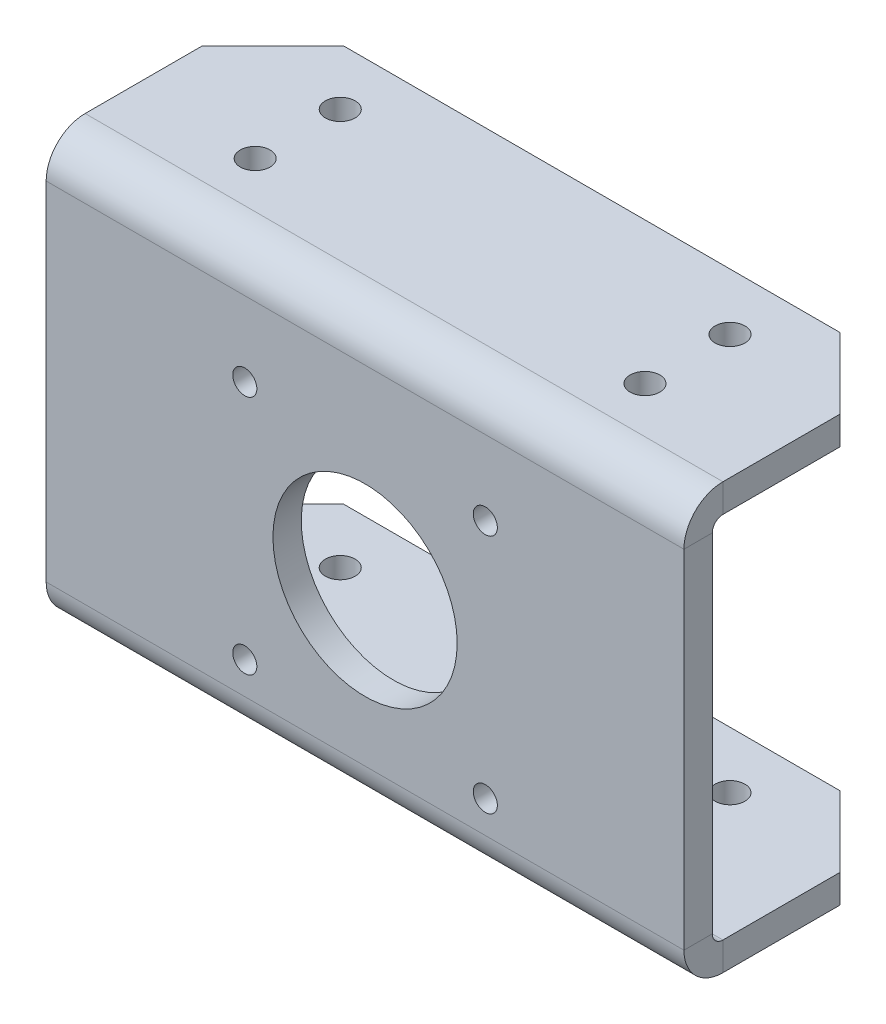
ISO-10303-21;
HEADER;
FILE_DESCRIPTION(('STEP AP214'),'2;1');
FILE_NAME('part.step','',(''),(''),'','','');
FILE_SCHEMA(('AUTOMOTIVE_DESIGN { 1 0 10303 214 1 1 1 1 }'));
ENDSEC;
DATA;
#1=APPLICATION_CONTEXT('core data for automotive mechanical design processes');
#2=APPLICATION_PROTOCOL_DEFINITION('international standard','automotive_design',2000,#1);
#3=PRODUCT_CONTEXT('',#1,'mechanical');
#4=PRODUCT('Part','Part','',(#3));
#5=PRODUCT_RELATED_PRODUCT_CATEGORY('part','',(#4));
#6=PRODUCT_DEFINITION_FORMATION('','',#4);
#7=PRODUCT_DEFINITION_CONTEXT('part definition',#1,'design');
#8=PRODUCT_DEFINITION('design','',#6,#7);
#9=PRODUCT_DEFINITION_SHAPE('','',#8);
#10=(LENGTH_UNIT() NAMED_UNIT(*) SI_UNIT(.MILLI.,.METRE.));
#11=(NAMED_UNIT(*) PLANE_ANGLE_UNIT() SI_UNIT($,.RADIAN.));
#12=(NAMED_UNIT(*) SI_UNIT($,.STERADIAN.) SOLID_ANGLE_UNIT());
#13=UNCERTAINTY_MEASURE_WITH_UNIT(LENGTH_MEASURE(1.E-05),#10,'distance_accuracy_value','');
#14=(GEOMETRIC_REPRESENTATION_CONTEXT(3) GLOBAL_UNCERTAINTY_ASSIGNED_CONTEXT((#13)) GLOBAL_UNIT_ASSIGNED_CONTEXT((#10,
#11,#12)) REPRESENTATION_CONTEXT('',''));
#15=CARTESIAN_POINT('',(0.,0.,0.));
#16=DIRECTION('',(0.,0.,1.));
#17=DIRECTION('',(1.,0.,0.));
#18=AXIS2_PLACEMENT_3D('',#15,#16,#17);
#19=CARTESIAN_POINT('',(45.,30.,0.));
#20=DIRECTION('',(0.,-1.,0.));
#21=DIRECTION('',(0.,0.,-1.));
#22=AXIS2_PLACEMENT_3D('',#19,#20,#21);
#23=PLANE('',#22);
#24=CARTESIAN_POINT('',(-27.5,30.,-24.));
#25=DIRECTION('',(0.,1.,0.));
#26=DIRECTION('',(0.,0.,1.));
#27=AXIS2_PLACEMENT_3D('',#24,#25,#26);
#28=CIRCLE('',#27,2.1);
#29=CARTESIAN_POINT('',(-27.5,30.,-21.9));
#30=VERTEX_POINT('',#29);
#31=EDGE_CURVE('E567',#30,#30,#28,.T.);
#32=ORIENTED_EDGE('',*,*,#31,.F.);
#33=EDGE_LOOP('',(#32));
#34=FACE_BOUND('',#33,.T.);
#35=CARTESIAN_POINT('',(-27.5,30.,-12.));
#36=DIRECTION('',(0.,1.,0.));
#37=DIRECTION('',(0.,0.,1.));
#38=AXIS2_PLACEMENT_3D('',#35,#36,#37);
#39=CIRCLE('',#38,2.1);
#40=CARTESIAN_POINT('',(-27.5,30.,-9.9));
#41=VERTEX_POINT('',#40);
#42=EDGE_CURVE('E319',#41,#41,#39,.T.);
#43=ORIENTED_EDGE('',*,*,#42,.F.);
#44=EDGE_LOOP('',(#43));
#45=FACE_BOUND('',#44,.T.);
#46=CARTESIAN_POINT('',(27.5,30.,-12.));
#47=DIRECTION('',(0.,1.,0.));
#48=DIRECTION('',(0.,0.,1.));
#49=AXIS2_PLACEMENT_3D('',#46,#47,#48);
#50=CIRCLE('',#49,2.1);
#51=CARTESIAN_POINT('',(27.5,30.,-9.9));
#52=VERTEX_POINT('',#51);
#53=EDGE_CURVE('E316',#52,#52,#50,.T.);
#54=ORIENTED_EDGE('',*,*,#53,.F.);
#55=EDGE_LOOP('',(#54));
#56=FACE_BOUND('',#55,.T.);
#57=DIRECTION('',(-1.,0.,0.));
#58=VECTOR('',#57,1.);
#59=CARTESIAN_POINT('',(45.,30.,-32.));
#60=LINE('',#59,#58);
#61=CARTESIAN_POINT('',(35.,30.,-32.));
#62=VERTEX_POINT('',#61);
#63=CARTESIAN_POINT('',(-34.9999999999999,30.,-32.));
#64=VERTEX_POINT('',#63);
#65=EDGE_CURVE('E248',#62,#64,#60,.T.);
#66=ORIENTED_EDGE('',*,*,#65,.T.);
#67=DIRECTION('',(-0.707106781186549,0.,0.707106781186546));
#68=VECTOR('',#67,1.);
#69=CARTESIAN_POINT('',(-45.,30.,-22.));
#70=LINE('',#69,#68);
#71=CARTESIAN_POINT('',(-45.,30.,-22.));
#72=VERTEX_POINT('',#71);
#73=EDGE_CURVE('E292',#64,#72,#70,.T.);
#74=ORIENTED_EDGE('',*,*,#73,.T.);
#75=DIRECTION('',(0.,0.,1.));
#76=VECTOR('',#75,1.);
#77=CARTESIAN_POINT('',(-45.,30.,0.));
#78=LINE('',#77,#76);
#79=CARTESIAN_POINT('',(-45.,30.,-5.49999999999999));
#80=VERTEX_POINT('',#79);
#81=EDGE_CURVE('E226',#72,#80,#78,.T.);
#82=ORIENTED_EDGE('',*,*,#81,.T.);
#83=DIRECTION('',(-1.,0.,0.));
#84=VECTOR('',#83,1.);
#85=CARTESIAN_POINT('',(45.,30.,-5.49999999999999));
#86=LINE('',#85,#84);
#87=CARTESIAN_POINT('',(45.,30.,-5.49999999999999));
#88=VERTEX_POINT('',#87);
#89=EDGE_CURVE('E245',#88,#80,#86,.T.);
#90=ORIENTED_EDGE('',*,*,#89,.F.);
#91=DIRECTION('',(0.,0.,1.));
#92=VECTOR('',#91,1.);
#93=CARTESIAN_POINT('',(45.,30.,0.));
#94=LINE('',#93,#92);
#95=CARTESIAN_POINT('',(45.,30.,-21.9999999999999));
#96=VERTEX_POINT('',#95);
#97=EDGE_CURVE('E201',#96,#88,#94,.T.);
#98=ORIENTED_EDGE('',*,*,#97,.F.);
#99=DIRECTION('',(0.707106781186547,0.,0.707106781186548));
#100=VECTOR('',#99,1.);
#101=CARTESIAN_POINT('',(35.,30.,-32.));
#102=LINE('',#101,#100);
#103=EDGE_CURVE('E290',#96,#62,#102,.F.);
#104=ORIENTED_EDGE('',*,*,#103,.T.);
#105=EDGE_LOOP('',(#66,#74,#82,#90,#98,#104));
#106=FACE_BOUND('',#105,.T.);
#107=CARTESIAN_POINT('',(27.5,30.,-24.));
#108=DIRECTION('',(0.,1.,0.));
#109=DIRECTION('',(0.,0.,1.));
#110=AXIS2_PLACEMENT_3D('',#107,#108,#109);
#111=CIRCLE('',#110,2.1);
#112=CARTESIAN_POINT('',(27.5,30.,-21.9));
#113=VERTEX_POINT('',#112);
#114=EDGE_CURVE('E339',#113,#113,#111,.T.);
#115=ORIENTED_EDGE('',*,*,#114,.F.);
#116=EDGE_LOOP('',(#115));
#117=FACE_BOUND('',#116,.T.);
#118=ADVANCED_FACE('F41',(#34,#45,#56,#106,#117),#23,.F.);
#119=CARTESIAN_POINT('',(45.,30.,-5.49999999999999));
#120=DIRECTION('',(1.,0.,0.));
#121=DIRECTION('',(0.,0.,-1.));
#122=AXIS2_PLACEMENT_3D('',#119,#120,#121);
#123=PLANE('',#122);
#124=DIRECTION('',(0.,-1.,0.));
#125=VECTOR('',#124,1.);
#126=CARTESIAN_POINT('',(45.,30.,-5.49999999999999));
#127=LINE('',#126,#125);
#128=CARTESIAN_POINT('',(45.,26.,-5.49999999999999));
#129=VERTEX_POINT('',#128);
#130=EDGE_CURVE('E275',#88,#129,#127,.T.);
#131=ORIENTED_EDGE('',*,*,#130,.F.);
#132=CARTESIAN_POINT('',(45.,24.5,-5.49999999999999));
#133=DIRECTION('',(-1.,0.,0.));
#134=DIRECTION('',(0.,0.,1.));
#135=AXIS2_PLACEMENT_3D('',#132,#133,#134);
#136=CIRCLE('',#135,5.5);
#137=CARTESIAN_POINT('',(45.,24.5,0.));
#138=VERTEX_POINT('',#137);
#139=EDGE_CURVE('E203',#88,#138,#136,.F.);
#140=ORIENTED_EDGE('',*,*,#139,.T.);
#141=DIRECTION('',(0.,0.,1.));
#142=VECTOR('',#141,1.);
#143=CARTESIAN_POINT('',(45.,24.5,-3.99999999999999));
#144=LINE('',#143,#142);
#145=CARTESIAN_POINT('',(45.,24.5,-3.99999999999999));
#146=VERTEX_POINT('',#145);
#147=EDGE_CURVE('E273',#146,#138,#144,.T.);
#148=ORIENTED_EDGE('',*,*,#147,.F.);
#149=CARTESIAN_POINT('',(45.,24.5,-5.49999999999999));
#150=DIRECTION('',(1.,0.,0.));
#151=DIRECTION('',(0.,0.,-1.));
#152=AXIS2_PLACEMENT_3D('',#149,#150,#151);
#153=CIRCLE('',#152,1.5);
#154=EDGE_CURVE('E193',#129,#146,#153,.T.);
#155=ORIENTED_EDGE('',*,*,#154,.F.);
#156=EDGE_LOOP('',(#131,#140,#148,#155));
#157=FACE_BOUND('',#156,.T.);
#158=ADVANCED_FACE('F397',(#157),#123,.T.);
#159=CARTESIAN_POINT('',(45.,24.5,-3.99999999999999));
#160=DIRECTION('',(1.,0.,0.));
#161=DIRECTION('',(0.,0.,-1.));
#162=AXIS2_PLACEMENT_3D('',#159,#160,#161);
#163=PLANE('',#162);
#164=DIRECTION('',(0.,0.,1.));
#165=VECTOR('',#164,1.);
#166=CARTESIAN_POINT('',(45.,26.,0.));
#167=LINE('',#166,#165);
#168=CARTESIAN_POINT('',(45.,26.,-22.));
#169=VERTEX_POINT('',#168);
#170=EDGE_CURVE('E199',#169,#129,#167,.T.);
#171=ORIENTED_EDGE('',*,*,#170,.F.);
#172=DIRECTION('',(0.,1.,0.));
#173=VECTOR('',#172,1.);
#174=CARTESIAN_POINT('',(45.,24.5,-22.));
#175=LINE('',#174,#173);
#176=EDGE_CURVE('E11',#169,#96,#175,.T.);
#177=ORIENTED_EDGE('',*,*,#176,.T.);
#178=ORIENTED_EDGE('',*,*,#97,.T.);
#179=ORIENTED_EDGE('',*,*,#130,.T.);
#180=EDGE_LOOP('',(#171,#177,#178,#179));
#181=FACE_BOUND('',#180,.T.);
#182=ADVANCED_FACE('F415',(#181),#163,.T.);
#183=CARTESIAN_POINT('',(-45.,24.5,0.));
#184=DIRECTION('',(-1.,0.,0.));
#185=DIRECTION('',(0.,0.,1.));
#186=AXIS2_PLACEMENT_3D('',#183,#184,#185);
#187=PLANE('',#186);
#188=DIRECTION('',(0.,0.,-1.));
#189=VECTOR('',#188,1.);
#190=CARTESIAN_POINT('',(-45.,24.5,0.));
#191=LINE('',#190,#189);
#192=CARTESIAN_POINT('',(-45.,24.5,0.));
#193=VERTEX_POINT('',#192);
#194=CARTESIAN_POINT('',(-45.,24.5,-3.99999999999999));
#195=VERTEX_POINT('',#194);
#196=EDGE_CURVE('E271',#193,#195,#191,.T.);
#197=ORIENTED_EDGE('',*,*,#196,.F.);
#198=CARTESIAN_POINT('',(-45.,24.5,-5.49999999999999));
#199=DIRECTION('',(-1.,0.,0.));
#200=DIRECTION('',(0.,0.,1.));
#201=AXIS2_PLACEMENT_3D('',#198,#199,#200);
#202=CIRCLE('',#201,5.5);
#203=EDGE_CURVE('E228',#80,#193,#202,.F.);
#204=ORIENTED_EDGE('',*,*,#203,.F.);
#205=DIRECTION('',(0.,1.,0.));
#206=VECTOR('',#205,1.);
#207=CARTESIAN_POINT('',(-45.,26.,-5.49999999999999));
#208=LINE('',#207,#206);
#209=CARTESIAN_POINT('',(-45.,26.,-5.49999999999999));
#210=VERTEX_POINT('',#209);
#211=EDGE_CURVE('E268',#210,#80,#208,.T.);
#212=ORIENTED_EDGE('',*,*,#211,.F.);
#213=CARTESIAN_POINT('',(-45.,24.5,-5.49999999999999));
#214=DIRECTION('',(1.,0.,0.));
#215=DIRECTION('',(0.,0.,-1.));
#216=AXIS2_PLACEMENT_3D('',#213,#214,#215);
#217=CIRCLE('',#216,1.5);
#218=EDGE_CURVE('E221',#210,#195,#217,.T.);
#219=ORIENTED_EDGE('',*,*,#218,.T.);
#220=EDGE_LOOP('',(#197,#204,#212,#219));
#221=FACE_BOUND('',#220,.T.);
#222=ADVANCED_FACE('F405',(#221),#187,.T.);
#223=CARTESIAN_POINT('',(-45.,26.,-5.49999999999999));
#224=DIRECTION('',(-1.,0.,0.));
#225=DIRECTION('',(0.,0.,1.));
#226=AXIS2_PLACEMENT_3D('',#223,#224,#225);
#227=PLANE('',#226);
#228=DIRECTION('',(0.,-1.,0.));
#229=VECTOR('',#228,1.);
#230=CARTESIAN_POINT('',(-45.,-30.,0.));
#231=LINE('',#230,#229);
#232=CARTESIAN_POINT('',(-45.,-24.5,0.));
#233=VERTEX_POINT('',#232);
#234=EDGE_CURVE('E231',#193,#233,#231,.T.);
#235=ORIENTED_EDGE('',*,*,#234,.F.);
#236=ORIENTED_EDGE('',*,*,#196,.T.);
#237=DIRECTION('',(0.,-1.,0.));
#238=VECTOR('',#237,1.);
#239=CARTESIAN_POINT('',(-45.,-30.,-4.));
#240=LINE('',#239,#238);
#241=CARTESIAN_POINT('',(-45.,-24.5,-4.));
#242=VERTEX_POINT('',#241);
#243=EDGE_CURVE('E218',#195,#242,#240,.T.);
#244=ORIENTED_EDGE('',*,*,#243,.T.);
#245=DIRECTION('',(0.,0.,1.));
#246=VECTOR('',#245,1.);
#247=CARTESIAN_POINT('',(-45.,-24.5,-4.));
#248=LINE('',#247,#246);
#249=EDGE_CURVE('E264',#242,#233,#248,.T.);
#250=ORIENTED_EDGE('',*,*,#249,.T.);
#251=EDGE_LOOP('',(#235,#236,#244,#250));
#252=FACE_BOUND('',#251,.T.);
#253=ADVANCED_FACE('F382',(#252),#227,.T.);
#254=CARTESIAN_POINT('',(45.,-24.5,0.));
#255=DIRECTION('',(1.,0.,0.));
#256=DIRECTION('',(0.,0.,-1.));
#257=AXIS2_PLACEMENT_3D('',#254,#255,#256);
#258=PLANE('',#257);
#259=DIRECTION('',(0.,0.,-1.));
#260=VECTOR('',#259,1.);
#261=CARTESIAN_POINT('',(45.,-24.5,0.));
#262=LINE('',#261,#260);
#263=CARTESIAN_POINT('',(45.,-24.5,0.));
#264=VERTEX_POINT('',#263);
#265=CARTESIAN_POINT('',(45.,-24.5,-4.));
#266=VERTEX_POINT('',#265);
#267=EDGE_CURVE('E167',#264,#266,#262,.T.);
#268=ORIENTED_EDGE('',*,*,#267,.F.);
#269=CARTESIAN_POINT('',(45.,-24.5,-5.5));
#270=DIRECTION('',(-1.,0.,0.));
#271=DIRECTION('',(0.,0.,1.));
#272=AXIS2_PLACEMENT_3D('',#269,#270,#271);
#273=CIRCLE('',#272,5.5);
#274=CARTESIAN_POINT('',(45.,-30.,-5.5));
#275=VERTEX_POINT('',#274);
#276=EDGE_CURVE('E165',#264,#275,#273,.F.);
#277=ORIENTED_EDGE('',*,*,#276,.T.);
#278=DIRECTION('',(0.,-1.,0.));
#279=VECTOR('',#278,1.);
#280=CARTESIAN_POINT('',(45.,-26.,-5.5));
#281=LINE('',#280,#279);
#282=CARTESIAN_POINT('',(45.,-26.,-5.5));
#283=VERTEX_POINT('',#282);
#284=EDGE_CURVE('E158',#283,#275,#281,.T.);
#285=ORIENTED_EDGE('',*,*,#284,.F.);
#286=CARTESIAN_POINT('',(45.,-24.5,-5.5));
#287=DIRECTION('',(1.,0.,0.));
#288=DIRECTION('',(0.,0.,-1.));
#289=AXIS2_PLACEMENT_3D('',#286,#287,#288);
#290=CIRCLE('',#289,1.5);
#291=EDGE_CURVE('E162',#266,#283,#290,.T.);
#292=ORIENTED_EDGE('',*,*,#291,.F.);
#293=EDGE_LOOP('',(#268,#277,#285,#292));
#294=FACE_BOUND('',#293,.T.);
#295=ADVANCED_FACE('F160',(#294),#258,.T.);
#296=CARTESIAN_POINT('',(45.,-26.,-5.5));
#297=DIRECTION('',(1.,0.,0.));
#298=DIRECTION('',(0.,0.,-1.));
#299=AXIS2_PLACEMENT_3D('',#296,#297,#298);
#300=PLANE('',#299);
#301=DIRECTION('',(0.,-1.,0.));
#302=VECTOR('',#301,1.);
#303=CARTESIAN_POINT('',(45.,-30.,0.));
#304=LINE('',#303,#302);
#305=EDGE_CURVE('E206',#138,#264,#304,.T.);
#306=ORIENTED_EDGE('',*,*,#305,.T.);
#307=ORIENTED_EDGE('',*,*,#267,.T.);
#308=DIRECTION('',(0.,-1.,0.));
#309=VECTOR('',#308,1.);
#310=CARTESIAN_POINT('',(45.,-30.,-4.));
#311=LINE('',#310,#309);
#312=EDGE_CURVE('E191',#146,#266,#311,.T.);
#313=ORIENTED_EDGE('',*,*,#312,.F.);
#314=ORIENTED_EDGE('',*,*,#147,.T.);
#315=EDGE_LOOP('',(#306,#307,#313,#314));
#316=FACE_BOUND('',#315,.T.);
#317=ADVANCED_FACE('F389',(#316),#300,.T.);
#318=CARTESIAN_POINT('',(-45.,-30.,-5.5));
#319=DIRECTION('',(-1.,0.,0.));
#320=DIRECTION('',(0.,0.,1.));
#321=AXIS2_PLACEMENT_3D('',#318,#319,#320);
#322=PLANE('',#321);
#323=DIRECTION('',(0.,1.,0.));
#324=VECTOR('',#323,1.);
#325=CARTESIAN_POINT('',(-45.,-30.,-5.5));
#326=LINE('',#325,#324);
#327=CARTESIAN_POINT('',(-45.,-30.,-5.5));
#328=VERTEX_POINT('',#327);
#329=CARTESIAN_POINT('',(-45.,-26.,-5.5));
#330=VERTEX_POINT('',#329);
#331=EDGE_CURVE('E168',#328,#330,#326,.T.);
#332=ORIENTED_EDGE('',*,*,#331,.F.);
#333=CARTESIAN_POINT('',(-45.,-24.5,-5.5));
#334=DIRECTION('',(-1.,0.,0.));
#335=DIRECTION('',(0.,0.,1.));
#336=AXIS2_PLACEMENT_3D('',#333,#334,#335);
#337=CIRCLE('',#336,5.5);
#338=EDGE_CURVE('E234',#233,#328,#337,.F.);
#339=ORIENTED_EDGE('',*,*,#338,.F.);
#340=ORIENTED_EDGE('',*,*,#249,.F.);
#341=CARTESIAN_POINT('',(-45.,-24.5,-5.5));
#342=DIRECTION('',(1.,0.,0.));
#343=DIRECTION('',(0.,0.,-1.));
#344=AXIS2_PLACEMENT_3D('',#341,#342,#343);
#345=CIRCLE('',#344,1.5);
#346=EDGE_CURVE('E216',#242,#330,#345,.T.);
#347=ORIENTED_EDGE('',*,*,#346,.T.);
#348=EDGE_LOOP('',(#332,#339,#340,#347));
#349=FACE_BOUND('',#348,.T.);
#350=ADVANCED_FACE('F372',(#349),#322,.T.);
#351=CARTESIAN_POINT('',(-45.,-24.5,-4.));
#352=DIRECTION('',(-1.,0.,0.));
#353=DIRECTION('',(0.,0.,1.));
#354=AXIS2_PLACEMENT_3D('',#351,#352,#353);
#355=PLANE('',#354);
#356=DIRECTION('',(0.,0.,-1.));
#357=VECTOR('',#356,1.);
#358=CARTESIAN_POINT('',(-45.,-26.,0.));
#359=LINE('',#358,#357);
#360=CARTESIAN_POINT('',(-45.,-26.,-22.));
#361=VERTEX_POINT('',#360);
#362=EDGE_CURVE('E178',#330,#361,#359,.T.);
#363=ORIENTED_EDGE('',*,*,#362,.T.);
#364=DIRECTION('',(0.,-1.,0.));
#365=VECTOR('',#364,1.);
#366=CARTESIAN_POINT('',(-45.,-24.5,-22.));
#367=LINE('',#366,#365);
#368=CARTESIAN_POINT('',(-45.,-30.,-22.));
#369=VERTEX_POINT('',#368);
#370=EDGE_CURVE('E294',#361,#369,#367,.T.);
#371=ORIENTED_EDGE('',*,*,#370,.T.);
#372=DIRECTION('',(0.,0.,-1.));
#373=VECTOR('',#372,1.);
#374=CARTESIAN_POINT('',(-45.,-30.,0.));
#375=LINE('',#374,#373);
#376=EDGE_CURVE('E211',#328,#369,#375,.T.);
#377=ORIENTED_EDGE('',*,*,#376,.F.);
#378=ORIENTED_EDGE('',*,*,#331,.T.);
#379=EDGE_LOOP('',(#363,#371,#377,#378));
#380=FACE_BOUND('',#379,.T.);
#381=ADVANCED_FACE('F369',(#380),#355,.T.);
#382=CARTESIAN_POINT('',(45.,-30.,0.));
#383=DIRECTION('',(0.,1.,0.));
#384=DIRECTION('',(0.,0.,1.));
#385=AXIS2_PLACEMENT_3D('',#382,#383,#384);
#386=PLANE('',#385);
#387=CARTESIAN_POINT('',(-27.5,-30.,-24.));
#388=DIRECTION('',(0.,1.,0.));
#389=DIRECTION('',(0.,0.,1.));
#390=AXIS2_PLACEMENT_3D('',#387,#388,#389);
#391=CIRCLE('',#390,2.09999999999999);
#392=CARTESIAN_POINT('',(-27.5,-30.,-21.9));
#393=VERTEX_POINT('',#392);
#394=EDGE_CURVE('E571',#393,#393,#391,.T.);
#395=ORIENTED_EDGE('',*,*,#394,.T.);
#396=EDGE_LOOP('',(#395));
#397=FACE_BOUND('',#396,.T.);
#398=CARTESIAN_POINT('',(-27.5,-30.,-12.));
#399=DIRECTION('',(0.,1.,0.));
#400=DIRECTION('',(0.,0.,1.));
#401=AXIS2_PLACEMENT_3D('',#398,#399,#400);
#402=CIRCLE('',#401,2.09999999999999);
#403=CARTESIAN_POINT('',(-27.5,-30.,-9.90000000000003));
#404=VERTEX_POINT('',#403);
#405=EDGE_CURVE('E312',#404,#404,#402,.T.);
#406=ORIENTED_EDGE('',*,*,#405,.T.);
#407=EDGE_LOOP('',(#406));
#408=FACE_BOUND('',#407,.T.);
#409=CARTESIAN_POINT('',(27.5,-30.,-12.));
#410=DIRECTION('',(0.,1.,0.));
#411=DIRECTION('',(0.,0.,1.));
#412=AXIS2_PLACEMENT_3D('',#409,#410,#411);
#413=CIRCLE('',#412,2.09999999999999);
#414=CARTESIAN_POINT('',(27.5,-30.,-9.90000000000004));
#415=VERTEX_POINT('',#414);
#416=EDGE_CURVE('E330',#415,#415,#413,.T.);
#417=ORIENTED_EDGE('',*,*,#416,.T.);
#418=EDGE_LOOP('',(#417));
#419=FACE_BOUND('',#418,.T.);
#420=CARTESIAN_POINT('',(27.5,-30.,-24.));
#421=DIRECTION('',(0.,1.,0.));
#422=DIRECTION('',(0.,0.,1.));
#423=AXIS2_PLACEMENT_3D('',#420,#421,#422);
#424=CIRCLE('',#423,2.09999999999999);
#425=CARTESIAN_POINT('',(27.5,-30.,-21.9));
#426=VERTEX_POINT('',#425);
#427=EDGE_CURVE('E342',#426,#426,#424,.T.);
#428=ORIENTED_EDGE('',*,*,#427,.T.);
#429=EDGE_LOOP('',(#428));
#430=FACE_BOUND('',#429,.T.);
#431=ORIENTED_EDGE('',*,*,#376,.T.);
#432=DIRECTION('',(-0.707106781186549,0.,0.707106781186546));
#433=VECTOR('',#432,1.);
#434=CARTESIAN_POINT('',(-45.,-30.,-22.));
#435=LINE('',#434,#433);
#436=CARTESIAN_POINT('',(-34.9999999999999,-30.,-32.));
#437=VERTEX_POINT('',#436);
#438=EDGE_CURVE('E299',#369,#437,#435,.F.);
#439=ORIENTED_EDGE('',*,*,#438,.T.);
#440=DIRECTION('',(-1.,0.,0.));
#441=VECTOR('',#440,1.);
#442=CARTESIAN_POINT('',(45.,-30.,-32.));
#443=LINE('',#442,#441);
#444=CARTESIAN_POINT('',(35.,-30.,-32.));
#445=VERTEX_POINT('',#444);
#446=EDGE_CURVE('E262',#445,#437,#443,.T.);
#447=ORIENTED_EDGE('',*,*,#446,.F.);
#448=DIRECTION('',(-0.707106781186547,0.,-0.707106781186548));
#449=VECTOR('',#448,1.);
#450=CARTESIAN_POINT('',(35.,-30.,-32.));
#451=LINE('',#450,#449);
#452=CARTESIAN_POINT('',(45.,-30.,-22.));
#453=VERTEX_POINT('',#452);
#454=EDGE_CURVE('E297',#445,#453,#451,.F.);
#455=ORIENTED_EDGE('',*,*,#454,.T.);
#456=DIRECTION('',(0.,0.,-1.));
#457=VECTOR('',#456,1.);
#458=CARTESIAN_POINT('',(45.,-30.,0.));
#459=LINE('',#458,#457);
#460=EDGE_CURVE('E186',#275,#453,#459,.T.);
#461=ORIENTED_EDGE('',*,*,#460,.F.);
#462=DIRECTION('',(-1.,0.,0.));
#463=VECTOR('',#462,1.);
#464=CARTESIAN_POINT('',(45.,-30.,-5.5));
#465=LINE('',#464,#463);
#466=EDGE_CURVE('E210',#275,#328,#465,.T.);
#467=ORIENTED_EDGE('',*,*,#466,.T.);
#468=EDGE_LOOP('',(#431,#439,#447,#455,#461,#467));
#469=FACE_BOUND('',#468,.T.);
#470=ADVANCED_FACE('F363',(#397,#408,#419,#430,#469),#386,.F.);
#471=CARTESIAN_POINT('',(45.,-26.,-32.));
#472=DIRECTION('',(0.,0.,-1.));
#473=DIRECTION('',(-1.,0.,0.));
#474=AXIS2_PLACEMENT_3D('',#471,#472,#473);
#475=PLANE('',#474);
#476=ORIENTED_EDGE('',*,*,#446,.T.);
#477=DIRECTION('',(0.,1.,0.));
#478=VECTOR('',#477,1.);
#479=CARTESIAN_POINT('',(-35.,-26.,-32.));
#480=LINE('',#479,#478);
#481=CARTESIAN_POINT('',(-34.9999999999999,-26.,-32.));
#482=VERTEX_POINT('',#481);
#483=EDGE_CURVE('E65',#437,#482,#480,.T.);
#484=ORIENTED_EDGE('',*,*,#483,.T.);
#485=DIRECTION('',(-1.,0.,0.));
#486=VECTOR('',#485,1.);
#487=CARTESIAN_POINT('',(45.,-26.,-32.));
#488=LINE('',#487,#486);
#489=CARTESIAN_POINT('',(35.,-26.,-32.));
#490=VERTEX_POINT('',#489);
#491=EDGE_CURVE('E182',#490,#482,#488,.T.);
#492=ORIENTED_EDGE('',*,*,#491,.F.);
#493=DIRECTION('',(0.,-1.,0.));
#494=VECTOR('',#493,1.);
#495=CARTESIAN_POINT('',(35.,-26.,-32.));
#496=LINE('',#495,#494);
#497=EDGE_CURVE('E301',#490,#445,#496,.T.);
#498=ORIENTED_EDGE('',*,*,#497,.T.);
#499=EDGE_LOOP('',(#476,#484,#492,#498));
#500=FACE_BOUND('',#499,.T.);
#501=ADVANCED_FACE('F361',(#500),#475,.T.);
#502=CARTESIAN_POINT('',(45.,-26.,0.));
#503=DIRECTION('',(0.,1.,0.));
#504=DIRECTION('',(0.,0.,1.));
#505=AXIS2_PLACEMENT_3D('',#502,#503,#504);
#506=PLANE('',#505);
#507=CARTESIAN_POINT('',(-27.5,-26.,-24.));
#508=DIRECTION('',(0.,1.,0.));
#509=DIRECTION('',(0.,0.,1.));
#510=AXIS2_PLACEMENT_3D('',#507,#508,#509);
#511=CIRCLE('',#510,2.09999999999999);
#512=CARTESIAN_POINT('',(-27.5,-26.,-21.9));
#513=VERTEX_POINT('',#512);
#514=EDGE_CURVE('E45',#513,#513,#511,.T.);
#515=ORIENTED_EDGE('',*,*,#514,.F.);
#516=EDGE_LOOP('',(#515));
#517=FACE_BOUND('',#516,.T.);
#518=CARTESIAN_POINT('',(-27.5,-26.,-12.));
#519=DIRECTION('',(0.,1.,0.));
#520=DIRECTION('',(0.,0.,1.));
#521=AXIS2_PLACEMENT_3D('',#518,#519,#520);
#522=CIRCLE('',#521,2.09999999999999);
#523=CARTESIAN_POINT('',(-27.5,-26.,-9.90000000000003));
#524=VERTEX_POINT('',#523);
#525=EDGE_CURVE('E311',#524,#524,#522,.T.);
#526=ORIENTED_EDGE('',*,*,#525,.F.);
#527=EDGE_LOOP('',(#526));
#528=FACE_BOUND('',#527,.T.);
#529=CARTESIAN_POINT('',(27.5,-26.,-12.));
#530=DIRECTION('',(0.,1.,0.));
#531=DIRECTION('',(0.,0.,1.));
#532=AXIS2_PLACEMENT_3D('',#529,#530,#531);
#533=CIRCLE('',#532,2.09999999999999);
#534=CARTESIAN_POINT('',(27.5,-26.,-9.90000000000003));
#535=VERTEX_POINT('',#534);
#536=EDGE_CURVE('E333',#535,#535,#533,.T.);
#537=ORIENTED_EDGE('',*,*,#536,.F.);
#538=EDGE_LOOP('',(#537));
#539=FACE_BOUND('',#538,.T.);
#540=CARTESIAN_POINT('',(27.5,-26.,-24.));
#541=DIRECTION('',(0.,1.,0.));
#542=DIRECTION('',(0.,0.,1.));
#543=AXIS2_PLACEMENT_3D('',#540,#541,#542);
#544=CIRCLE('',#543,2.09999999999999);
#545=CARTESIAN_POINT('',(27.5,-26.,-21.9));
#546=VERTEX_POINT('',#545);
#547=EDGE_CURVE('E345',#546,#546,#544,.T.);
#548=ORIENTED_EDGE('',*,*,#547,.F.);
#549=EDGE_LOOP('',(#548));
#550=FACE_BOUND('',#549,.T.);
#551=ORIENTED_EDGE('',*,*,#491,.T.);
#552=DIRECTION('',(0.707106781186549,0.,-0.707106781186546));
#553=VECTOR('',#552,1.);
#554=CARTESIAN_POINT('',(-10.9999999999998,-26.,-56.));
#555=LINE('',#554,#553);
#556=EDGE_CURVE('E307',#482,#361,#555,.F.);
#557=ORIENTED_EDGE('',*,*,#556,.T.);
#558=ORIENTED_EDGE('',*,*,#362,.F.);
#559=DIRECTION('',(-1.,0.,0.));
#560=VECTOR('',#559,1.);
#561=CARTESIAN_POINT('',(45.,-26.,-5.5));
#562=LINE('',#561,#560);
#563=EDGE_CURVE('E173',#283,#330,#562,.T.);
#564=ORIENTED_EDGE('',*,*,#563,.F.);
#565=DIRECTION('',(0.,0.,-1.));
#566=VECTOR('',#565,1.);
#567=CARTESIAN_POINT('',(45.,-26.,0.));
#568=LINE('',#567,#566);
#569=CARTESIAN_POINT('',(45.,-26.,-22.));
#570=VERTEX_POINT('',#569);
#571=EDGE_CURVE('E175',#283,#570,#568,.T.);
#572=ORIENTED_EDGE('',*,*,#571,.T.);
#573=DIRECTION('',(0.707106781186547,0.,0.707106781186548));
#574=VECTOR('',#573,1.);
#575=CARTESIAN_POINT('',(56.,-26.,-11.));
#576=LINE('',#575,#574);
#577=EDGE_CURVE('E305',#570,#490,#576,.F.);
#578=ORIENTED_EDGE('',*,*,#577,.T.);
#579=EDGE_LOOP('',(#551,#557,#558,#564,#572,#578));
#580=FACE_BOUND('',#579,.T.);
#581=ADVANCED_FACE('F174',(#517,#528,#539,#550,#580),#506,.T.);
#582=CARTESIAN_POINT('',(45.,-24.5,-5.5));
#583=DIRECTION('',(-1.,0.,0.));
#584=DIRECTION('',(0.,0.,1.));
#585=AXIS2_PLACEMENT_3D('',#582,#583,#584);
#586=CYLINDRICAL_SURFACE('',#585,1.5);
#587=ORIENTED_EDGE('',*,*,#346,.F.);
#588=DIRECTION('',(-1.,0.,0.));
#589=VECTOR('',#588,1.);
#590=CARTESIAN_POINT('',(45.,-24.5,-4.));
#591=LINE('',#590,#589);
#592=EDGE_CURVE('E183',#266,#242,#591,.T.);
#593=ORIENTED_EDGE('',*,*,#592,.F.);
#594=ORIENTED_EDGE('',*,*,#291,.T.);
#595=ORIENTED_EDGE('',*,*,#563,.T.);
#596=EDGE_LOOP('',(#587,#593,#594,#595));
#597=FACE_BOUND('',#596,.T.);
#598=ADVANCED_FACE('F189',(#597),#586,.F.);
#599=CARTESIAN_POINT('',(45.,-30.,-4.));
#600=DIRECTION('',(0.,0.,-1.));
#601=DIRECTION('',(0.,1.,0.));
#602=AXIS2_PLACEMENT_3D('',#599,#600,#601);
#603=PLANE('',#602);
#604=CARTESIAN_POINT('',(-16.9705627484771,-19.9705627484772,-4.));
#605=DIRECTION('',(0.,0.,-1.));
#606=DIRECTION('',(0.,1.,0.));
#607=AXIS2_PLACEMENT_3D('',#604,#605,#606);
#608=CIRCLE('',#607,1.7);
#609=CARTESIAN_POINT('',(-16.9705627484771,-18.2705627484772,-4.));
#610=VERTEX_POINT('',#609);
#611=EDGE_CURVE('E542',#610,#610,#608,.F.);
#612=ORIENTED_EDGE('',*,*,#611,.T.);
#613=EDGE_LOOP('',(#612));
#614=FACE_BOUND('',#613,.T.);
#615=CARTESIAN_POINT('',(16.9705627484771,-19.9705627484771,-4.));
#616=DIRECTION('',(0.,0.,-1.));
#617=DIRECTION('',(0.,1.,0.));
#618=AXIS2_PLACEMENT_3D('',#615,#616,#617);
#619=CIRCLE('',#618,1.7);
#620=CARTESIAN_POINT('',(16.9705627484771,-18.2705627484771,-4.));
#621=VERTEX_POINT('',#620);
#622=EDGE_CURVE('E557',#621,#621,#619,.F.);
#623=ORIENTED_EDGE('',*,*,#622,.T.);
#624=EDGE_LOOP('',(#623));
#625=FACE_BOUND('',#624,.T.);
#626=CARTESIAN_POINT('',(16.970562748477,13.9705627484773,-3.99999999999999));
#627=DIRECTION('',(0.,0.,-1.));
#628=DIRECTION('',(0.,1.,0.));
#629=AXIS2_PLACEMENT_3D('',#626,#627,#628);
#630=CIRCLE('',#629,1.7);
#631=CARTESIAN_POINT('',(16.970562748477,15.6705627484773,-3.99999999999999));
#632=VERTEX_POINT('',#631);
#633=EDGE_CURVE('E563',#632,#632,#630,.F.);
#634=ORIENTED_EDGE('',*,*,#633,.T.);
#635=EDGE_LOOP('',(#634));
#636=FACE_BOUND('',#635,.T.);
#637=CARTESIAN_POINT('',(-16.9705627484771,13.9705627484771,-3.99999999999999));
#638=DIRECTION('',(0.,0.,-1.));
#639=DIRECTION('',(0.,1.,0.));
#640=AXIS2_PLACEMENT_3D('',#637,#638,#639);
#641=CIRCLE('',#640,1.7);
#642=CARTESIAN_POINT('',(-16.9705627484771,15.6705627484771,-3.99999999999999));
#643=VERTEX_POINT('',#642);
#644=EDGE_CURVE('E547',#643,#643,#641,.F.);
#645=ORIENTED_EDGE('',*,*,#644,.T.);
#646=EDGE_LOOP('',(#645));
#647=FACE_BOUND('',#646,.T.);
#648=CARTESIAN_POINT('',(0.,-3.,-4.));
#649=DIRECTION('',(0.,0.,-1.));
#650=DIRECTION('',(0.,1.,0.));
#651=AXIS2_PLACEMENT_3D('',#648,#649,#650);
#652=CIRCLE('',#651,13.);
#653=CARTESIAN_POINT('',(0.,10.,-3.99999999999999));
#654=VERTEX_POINT('',#653);
#655=EDGE_CURVE('E214',#654,#654,#652,.T.);
#656=ORIENTED_EDGE('',*,*,#655,.F.);
#657=EDGE_LOOP('',(#656));
#658=FACE_BOUND('',#657,.T.);
#659=ORIENTED_EDGE('',*,*,#243,.F.);
#660=DIRECTION('',(-1.,0.,0.));
#661=VECTOR('',#660,1.);
#662=CARTESIAN_POINT('',(45.,24.5,-3.99999999999999));
#663=LINE('',#662,#661);
#664=EDGE_CURVE('E257',#146,#195,#663,.T.);
#665=ORIENTED_EDGE('',*,*,#664,.F.);
#666=ORIENTED_EDGE('',*,*,#312,.T.);
#667=ORIENTED_EDGE('',*,*,#592,.T.);
#668=EDGE_LOOP('',(#659,#665,#666,#667));
#669=FACE_BOUND('',#668,.T.);
#670=ADVANCED_FACE('F385',(#614,#625,#636,#647,#658,#669),#603,.T.);
#671=CARTESIAN_POINT('',(45.,24.5,-5.49999999999999));
#672=DIRECTION('',(-1.,0.,0.));
#673=DIRECTION('',(0.,0.,1.));
#674=AXIS2_PLACEMENT_3D('',#671,#672,#673);
#675=CYLINDRICAL_SURFACE('',#674,1.5);
#676=ORIENTED_EDGE('',*,*,#218,.F.);
#677=DIRECTION('',(-1.,0.,0.));
#678=VECTOR('',#677,1.);
#679=CARTESIAN_POINT('',(45.,26.,-5.49999999999999));
#680=LINE('',#679,#678);
#681=EDGE_CURVE('E254',#129,#210,#680,.T.);
#682=ORIENTED_EDGE('',*,*,#681,.F.);
#683=ORIENTED_EDGE('',*,*,#154,.T.);
#684=ORIENTED_EDGE('',*,*,#664,.T.);
#685=EDGE_LOOP('',(#676,#682,#683,#684));
#686=FACE_BOUND('',#685,.T.);
#687=ADVANCED_FACE('F394',(#686),#675,.F.);
#688=CARTESIAN_POINT('',(45.,26.,0.));
#689=DIRECTION('',(0.,-1.,0.));
#690=DIRECTION('',(0.,0.,-1.));
#691=AXIS2_PLACEMENT_3D('',#688,#689,#690);
#692=PLANE('',#691);
#693=CARTESIAN_POINT('',(-27.5,26.,-24.));
#694=DIRECTION('',(0.,-1.,0.));
#695=DIRECTION('',(0.,0.,-1.));
#696=AXIS2_PLACEMENT_3D('',#693,#694,#695);
#697=CIRCLE('',#696,2.09999999999999);
#698=CARTESIAN_POINT('',(-27.5,26.,-26.1));
#699=VERTEX_POINT('',#698);
#700=EDGE_CURVE('E324',#699,#699,#697,.T.);
#701=ORIENTED_EDGE('',*,*,#700,.F.);
#702=EDGE_LOOP('',(#701));
#703=FACE_BOUND('',#702,.T.);
#704=CARTESIAN_POINT('',(-27.5,26.,-12.));
#705=DIRECTION('',(0.,-1.,0.));
#706=DIRECTION('',(0.,0.,-1.));
#707=AXIS2_PLACEMENT_3D('',#704,#705,#706);
#708=CIRCLE('',#707,2.09999999999999);
#709=CARTESIAN_POINT('',(-27.5,26.,-14.1));
#710=VERTEX_POINT('',#709);
#711=EDGE_CURVE('E309',#710,#710,#708,.T.);
#712=ORIENTED_EDGE('',*,*,#711,.F.);
#713=EDGE_LOOP('',(#712));
#714=FACE_BOUND('',#713,.T.);
#715=CARTESIAN_POINT('',(27.5,26.,-12.));
#716=DIRECTION('',(0.,-1.,0.));
#717=DIRECTION('',(0.,0.,-1.));
#718=AXIS2_PLACEMENT_3D('',#715,#716,#717);
#719=CIRCLE('',#718,2.09999999999999);
#720=CARTESIAN_POINT('',(27.5,26.,-14.1));
#721=VERTEX_POINT('',#720);
#722=EDGE_CURVE('E336',#721,#721,#719,.T.);
#723=ORIENTED_EDGE('',*,*,#722,.F.);
#724=EDGE_LOOP('',(#723));
#725=FACE_BOUND('',#724,.T.);
#726=CARTESIAN_POINT('',(27.5,26.,-24.));
#727=DIRECTION('',(0.,-1.,0.));
#728=DIRECTION('',(0.,0.,-1.));
#729=AXIS2_PLACEMENT_3D('',#726,#727,#728);
#730=CIRCLE('',#729,2.09999999999999);
#731=CARTESIAN_POINT('',(27.5,26.,-26.1));
#732=VERTEX_POINT('',#731);
#733=EDGE_CURVE('E348',#732,#732,#730,.T.);
#734=ORIENTED_EDGE('',*,*,#733,.F.);
#735=EDGE_LOOP('',(#734));
#736=FACE_BOUND('',#735,.T.);
#737=DIRECTION('',(0.,0.,1.));
#738=VECTOR('',#737,1.);
#739=CARTESIAN_POINT('',(-45.,26.,0.));
#740=LINE('',#739,#738);
#741=CARTESIAN_POINT('',(-45.,26.,-22.));
#742=VERTEX_POINT('',#741);
#743=EDGE_CURVE('E224',#742,#210,#740,.T.);
#744=ORIENTED_EDGE('',*,*,#743,.F.);
#745=DIRECTION('',(0.707106781186549,0.,-0.707106781186546));
#746=VECTOR('',#745,1.);
#747=CARTESIAN_POINT('',(-10.9999999999999,26.,-56.));
#748=LINE('',#747,#746);
#749=CARTESIAN_POINT('',(-34.9999999999999,26.,-32.));
#750=VERTEX_POINT('',#749);
#751=EDGE_CURVE('E283',#742,#750,#748,.T.);
#752=ORIENTED_EDGE('',*,*,#751,.T.);
#753=DIRECTION('',(-1.,0.,0.));
#754=VECTOR('',#753,1.);
#755=CARTESIAN_POINT('',(45.,26.,-32.));
#756=LINE('',#755,#754);
#757=CARTESIAN_POINT('',(35.,26.,-32.));
#758=VERTEX_POINT('',#757);
#759=EDGE_CURVE('E251',#758,#750,#756,.T.);
#760=ORIENTED_EDGE('',*,*,#759,.F.);
#761=DIRECTION('',(-0.707106781186547,0.,-0.707106781186548));
#762=VECTOR('',#761,1.);
#763=CARTESIAN_POINT('',(56.,26.,-10.9999999999999));
#764=LINE('',#763,#762);
#765=EDGE_CURVE('E281',#758,#169,#764,.F.);
#766=ORIENTED_EDGE('',*,*,#765,.T.);
#767=ORIENTED_EDGE('',*,*,#170,.T.);
#768=ORIENTED_EDGE('',*,*,#681,.T.);
#769=EDGE_LOOP('',(#744,#752,#760,#766,#767,#768));
#770=FACE_BOUND('',#769,.T.);
#771=ADVANCED_FACE('F410',(#703,#714,#725,#736,#770),#692,.T.);
#772=CARTESIAN_POINT('',(45.,30.,-32.));
#773=DIRECTION('',(0.,0.,-1.));
#774=DIRECTION('',(0.,1.,0.));
#775=AXIS2_PLACEMENT_3D('',#772,#773,#774);
#776=PLANE('',#775);
#777=ORIENTED_EDGE('',*,*,#759,.T.);
#778=DIRECTION('',(0.,1.,0.));
#779=VECTOR('',#778,1.);
#780=CARTESIAN_POINT('',(-35.,30.,-32.));
#781=LINE('',#780,#779);
#782=EDGE_CURVE('E288',#750,#64,#781,.T.);
#783=ORIENTED_EDGE('',*,*,#782,.T.);
#784=ORIENTED_EDGE('',*,*,#65,.F.);
#785=DIRECTION('',(0.,-1.,0.));
#786=VECTOR('',#785,1.);
#787=CARTESIAN_POINT('',(35.,30.,-32.));
#788=LINE('',#787,#786);
#789=EDGE_CURVE('E285',#62,#758,#788,.T.);
#790=ORIENTED_EDGE('',*,*,#789,.T.);
#791=EDGE_LOOP('',(#777,#783,#784,#790));
#792=FACE_BOUND('',#791,.T.);
#793=ADVANCED_FACE('F424',(#792),#776,.T.);
#794=CARTESIAN_POINT('',(45.,24.5,-5.49999999999999));
#795=DIRECTION('',(-1.,0.,0.));
#796=DIRECTION('',(0.,0.,1.));
#797=AXIS2_PLACEMENT_3D('',#794,#795,#796);
#798=CYLINDRICAL_SURFACE('',#797,5.5);
#799=ORIENTED_EDGE('',*,*,#203,.T.);
#800=DIRECTION('',(-1.,0.,0.));
#801=VECTOR('',#800,1.);
#802=CARTESIAN_POINT('',(45.,24.5,0.));
#803=LINE('',#802,#801);
#804=EDGE_CURVE('E242',#138,#193,#803,.T.);
#805=ORIENTED_EDGE('',*,*,#804,.F.);
#806=ORIENTED_EDGE('',*,*,#139,.F.);
#807=ORIENTED_EDGE('',*,*,#89,.T.);
#808=EDGE_LOOP('',(#799,#805,#806,#807));
#809=FACE_BOUND('',#808,.T.);
#810=ADVANCED_FACE('F401',(#809),#798,.T.);
#811=CARTESIAN_POINT('',(45.,-30.,0.));
#812=DIRECTION('',(0.,0.,-1.));
#813=DIRECTION('',(0.,1.,0.));
#814=AXIS2_PLACEMENT_3D('',#811,#812,#813);
#815=PLANE('',#814);
#816=CARTESIAN_POINT('',(-16.9705627484771,-19.9705627484772,0.));
#817=DIRECTION('',(0.,0.,1.));
#818=DIRECTION('',(0.,1.,0.));
#819=AXIS2_PLACEMENT_3D('',#816,#817,#818);
#820=CIRCLE('',#819,1.7);
#821=CARTESIAN_POINT('',(-16.9705627484771,-18.2705627484772,0.));
#822=VERTEX_POINT('',#821);
#823=EDGE_CURVE('E545',#822,#822,#820,.T.);
#824=ORIENTED_EDGE('',*,*,#823,.F.);
#825=EDGE_LOOP('',(#824));
#826=FACE_BOUND('',#825,.T.);
#827=CARTESIAN_POINT('',(16.9705627484771,-19.9705627484771,0.));
#828=DIRECTION('',(0.,0.,1.));
#829=DIRECTION('',(-1.,0.,0.));
#830=AXIS2_PLACEMENT_3D('',#827,#828,#829);
#831=CIRCLE('',#830,1.7);
#832=CARTESIAN_POINT('',(15.2705627484771,-19.9705627484771,0.));
#833=VERTEX_POINT('',#832);
#834=EDGE_CURVE('E552',#833,#833,#831,.T.);
#835=ORIENTED_EDGE('',*,*,#834,.F.);
#836=EDGE_LOOP('',(#835));
#837=FACE_BOUND('',#836,.T.);
#838=CARTESIAN_POINT('',(16.970562748477,13.9705627484773,0.));
#839=DIRECTION('',(0.,0.,1.));
#840=DIRECTION('',(0.,-1.,0.));
#841=AXIS2_PLACEMENT_3D('',#838,#839,#840);
#842=CIRCLE('',#841,1.7);
#843=CARTESIAN_POINT('',(16.970562748477,12.2705627484773,0.));
#844=VERTEX_POINT('',#843);
#845=EDGE_CURVE('E560',#844,#844,#842,.T.);
#846=ORIENTED_EDGE('',*,*,#845,.F.);
#847=EDGE_LOOP('',(#846));
#848=FACE_BOUND('',#847,.T.);
#849=CARTESIAN_POINT('',(-16.9705627484771,13.9705627484771,0.));
#850=DIRECTION('',(0.,0.,1.));
#851=DIRECTION('',(1.,0.,0.));
#852=AXIS2_PLACEMENT_3D('',#849,#850,#851);
#853=CIRCLE('',#852,1.7);
#854=CARTESIAN_POINT('',(-15.2705627484771,13.9705627484771,0.));
#855=VERTEX_POINT('',#854);
#856=EDGE_CURVE('E550',#855,#855,#853,.T.);
#857=ORIENTED_EDGE('',*,*,#856,.F.);
#858=EDGE_LOOP('',(#857));
#859=FACE_BOUND('',#858,.T.);
#860=CARTESIAN_POINT('',(0.,-3.,0.));
#861=DIRECTION('',(0.,0.,1.));
#862=DIRECTION('',(1.,0.,0.));
#863=AXIS2_PLACEMENT_3D('',#860,#861,#862);
#864=CIRCLE('',#863,13.);
#865=CARTESIAN_POINT('',(13.,-3.,0.));
#866=VERTEX_POINT('',#865);
#867=EDGE_CURVE('E351',#866,#866,#864,.T.);
#868=ORIENTED_EDGE('',*,*,#867,.F.);
#869=EDGE_LOOP('',(#868));
#870=FACE_BOUND('',#869,.T.);
#871=ORIENTED_EDGE('',*,*,#234,.T.);
#872=DIRECTION('',(-1.,0.,0.));
#873=VECTOR('',#872,1.);
#874=CARTESIAN_POINT('',(45.,-24.5,0.));
#875=LINE('',#874,#873);
#876=EDGE_CURVE('E239',#264,#233,#875,.T.);
#877=ORIENTED_EDGE('',*,*,#876,.F.);
#878=ORIENTED_EDGE('',*,*,#305,.F.);
#879=ORIENTED_EDGE('',*,*,#804,.T.);
#880=EDGE_LOOP('',(#871,#877,#878,#879));
#881=FACE_BOUND('',#880,.T.);
#882=ADVANCED_FACE('F378',(#826,#837,#848,#859,#870,#881),#815,.F.);
#883=CARTESIAN_POINT('',(45.,-24.5,-5.5));
#884=DIRECTION('',(-1.,0.,0.));
#885=DIRECTION('',(0.,0.,1.));
#886=AXIS2_PLACEMENT_3D('',#883,#884,#885);
#887=CYLINDRICAL_SURFACE('',#886,5.5);
#888=ORIENTED_EDGE('',*,*,#338,.T.);
#889=ORIENTED_EDGE('',*,*,#466,.F.);
#890=ORIENTED_EDGE('',*,*,#276,.F.);
#891=ORIENTED_EDGE('',*,*,#876,.T.);
#892=EDGE_LOOP('',(#888,#889,#890,#891));
#893=FACE_BOUND('',#892,.T.);
#894=ADVANCED_FACE('F374',(#893),#887,.T.);
#895=CARTESIAN_POINT('',(45.,-24.5,-5.5));
#896=DIRECTION('',(1.,0.,0.));
#897=DIRECTION('',(0.,0.,-1.));
#898=AXIS2_PLACEMENT_3D('',#895,#896,#897);
#899=PLANE('',#898);
#900=ORIENTED_EDGE('',*,*,#460,.T.);
#901=DIRECTION('',(0.,1.,0.));
#902=VECTOR('',#901,1.);
#903=CARTESIAN_POINT('',(45.,-24.5,-22.));
#904=LINE('',#903,#902);
#905=EDGE_CURVE('E50',#453,#570,#904,.T.);
#906=ORIENTED_EDGE('',*,*,#905,.T.);
#907=ORIENTED_EDGE('',*,*,#571,.F.);
#908=ORIENTED_EDGE('',*,*,#284,.T.);
#909=EDGE_LOOP('',(#900,#906,#907,#908));
#910=FACE_BOUND('',#909,.T.);
#911=ADVANCED_FACE('F185',(#910),#899,.T.);
#912=CARTESIAN_POINT('',(-45.,-24.5,-5.5));
#913=DIRECTION('',(1.,0.,0.));
#914=DIRECTION('',(0.,0.,-1.));
#915=AXIS2_PLACEMENT_3D('',#912,#913,#914);
#916=PLANE('',#915);
#917=ORIENTED_EDGE('',*,*,#81,.F.);
#918=DIRECTION('',(0.,-1.,0.));
#919=VECTOR('',#918,1.);
#920=CARTESIAN_POINT('',(-45.,26.,-22.));
#921=LINE('',#920,#919);
#922=EDGE_CURVE('E278',#72,#742,#921,.T.);
#923=ORIENTED_EDGE('',*,*,#922,.T.);
#924=ORIENTED_EDGE('',*,*,#743,.T.);
#925=ORIENTED_EDGE('',*,*,#211,.T.);
#926=EDGE_LOOP('',(#917,#923,#924,#925));
#927=FACE_BOUND('',#926,.T.);
#928=ADVANCED_FACE('F430',(#927),#916,.F.);
#929=CARTESIAN_POINT('',(0.,-3.,-32.));
#930=DIRECTION('',(0.,0.,1.));
#931=DIRECTION('',(1.,0.,0.));
#932=AXIS2_PLACEMENT_3D('',#929,#930,#931);
#933=CYLINDRICAL_SURFACE('',#932,13.);
#934=ORIENTED_EDGE('',*,*,#655,.T.);
#935=EDGE_LOOP('',(#934));
#936=FACE_BOUND('',#935,.T.);
#937=ORIENTED_EDGE('',*,*,#867,.T.);
#938=EDGE_LOOP('',(#937));
#939=FACE_BOUND('',#938,.T.);
#940=ADVANCED_FACE('F432',(#936,#939),#933,.F.);
#941=CARTESIAN_POINT('',(-45.,-24.5,-22.0000000000001));
#942=DIRECTION('',(-0.707106781186546,0.,-0.707106781186549));
#943=DIRECTION('',(0.,1.,0.));
#944=AXIS2_PLACEMENT_3D('',#941,#942,#943);
#945=PLANE('',#944);
#946=ORIENTED_EDGE('',*,*,#73,.F.);
#947=ORIENTED_EDGE('',*,*,#782,.F.);
#948=ORIENTED_EDGE('',*,*,#751,.F.);
#949=ORIENTED_EDGE('',*,*,#922,.F.);
#950=EDGE_LOOP('',(#946,#947,#948,#949));
#951=FACE_BOUND('',#950,.T.);
#952=ADVANCED_FACE('F429',(#951),#945,.T.);
#953=CARTESIAN_POINT('',(-45.,-24.5,-22.));
#954=DIRECTION('',(0.707106781186546,0.,0.707106781186549));
#955=DIRECTION('',(0.,-1.,0.));
#956=AXIS2_PLACEMENT_3D('',#953,#954,#955);
#957=PLANE('',#956);
#958=ORIENTED_EDGE('',*,*,#556,.F.);
#959=ORIENTED_EDGE('',*,*,#483,.F.);
#960=ORIENTED_EDGE('',*,*,#438,.F.);
#961=ORIENTED_EDGE('',*,*,#370,.F.);
#962=EDGE_LOOP('',(#958,#959,#960,#961));
#963=FACE_BOUND('',#962,.T.);
#964=ADVANCED_FACE('F367',(#963),#957,.F.);
#965=CARTESIAN_POINT('',(35.,-26.,-32.));
#966=DIRECTION('',(-0.707106781186548,0.,0.707106781186547));
#967=DIRECTION('',(0.,-1.,0.));
#968=AXIS2_PLACEMENT_3D('',#965,#966,#967);
#969=PLANE('',#968);
#970=ORIENTED_EDGE('',*,*,#577,.F.);
#971=ORIENTED_EDGE('',*,*,#905,.F.);
#972=ORIENTED_EDGE('',*,*,#454,.F.);
#973=ORIENTED_EDGE('',*,*,#497,.F.);
#974=EDGE_LOOP('',(#970,#971,#972,#973));
#975=FACE_BOUND('',#974,.T.);
#976=ADVANCED_FACE('F358',(#975),#969,.F.);
#977=CARTESIAN_POINT('',(35.,30.,-32.));
#978=DIRECTION('',(-0.707106781186548,0.,0.707106781186547));
#979=DIRECTION('',(0.,-1.,0.));
#980=AXIS2_PLACEMENT_3D('',#977,#978,#979);
#981=PLANE('',#980);
#982=ORIENTED_EDGE('',*,*,#103,.F.);
#983=ORIENTED_EDGE('',*,*,#176,.F.);
#984=ORIENTED_EDGE('',*,*,#765,.F.);
#985=ORIENTED_EDGE('',*,*,#789,.F.);
#986=EDGE_LOOP('',(#982,#983,#984,#985));
#987=FACE_BOUND('',#986,.T.);
#988=ADVANCED_FACE('F43',(#987),#981,.F.);
#989=CARTESIAN_POINT('',(27.5,30.,-24.));
#990=DIRECTION('',(0.,1.,0.));
#991=DIRECTION('',(0.,0.,1.));
#992=AXIS2_PLACEMENT_3D('',#989,#990,#991);
#993=CYLINDRICAL_SURFACE('',#992,2.09999999999999);
#994=ORIENTED_EDGE('',*,*,#733,.T.);
#995=EDGE_LOOP('',(#994));
#996=FACE_BOUND('',#995,.T.);
#997=ORIENTED_EDGE('',*,*,#114,.T.);
#998=EDGE_LOOP('',(#997));
#999=FACE_BOUND('',#998,.T.);
#1000=ADVANCED_FACE('F495',(#996,#999),#993,.F.);
#1001=ORIENTED_EDGE('',*,*,#547,.T.);
#1002=EDGE_LOOP('',(#1001));
#1003=FACE_BOUND('',#1002,.T.);
#1004=ORIENTED_EDGE('',*,*,#427,.F.);
#1005=EDGE_LOOP('',(#1004));
#1006=FACE_BOUND('',#1005,.T.);
#1007=ADVANCED_FACE('F499',(#1003,#1006),#993,.F.);
#1008=CARTESIAN_POINT('',(27.5,30.,-12.));
#1009=DIRECTION('',(0.,1.,0.));
#1010=DIRECTION('',(0.,0.,1.));
#1011=AXIS2_PLACEMENT_3D('',#1008,#1009,#1010);
#1012=CYLINDRICAL_SURFACE('',#1011,2.09999999999999);
#1013=ORIENTED_EDGE('',*,*,#536,.T.);
#1014=EDGE_LOOP('',(#1013));
#1015=FACE_BOUND('',#1014,.T.);
#1016=ORIENTED_EDGE('',*,*,#416,.F.);
#1017=EDGE_LOOP('',(#1016));
#1018=FACE_BOUND('',#1017,.T.);
#1019=ADVANCED_FACE('F505',(#1015,#1018),#1012,.F.);
#1020=ORIENTED_EDGE('',*,*,#722,.T.);
#1021=EDGE_LOOP('',(#1020));
#1022=FACE_BOUND('',#1021,.T.);
#1023=ORIENTED_EDGE('',*,*,#53,.T.);
#1024=EDGE_LOOP('',(#1023));
#1025=FACE_BOUND('',#1024,.T.);
#1026=ADVANCED_FACE('F511',(#1022,#1025),#1012,.F.);
#1027=CARTESIAN_POINT('',(-27.5,30.,-12.));
#1028=DIRECTION('',(0.,1.,0.));
#1029=DIRECTION('',(0.,0.,1.));
#1030=AXIS2_PLACEMENT_3D('',#1027,#1028,#1029);
#1031=CYLINDRICAL_SURFACE('',#1030,2.09999999999999);
#1032=ORIENTED_EDGE('',*,*,#711,.T.);
#1033=EDGE_LOOP('',(#1032));
#1034=FACE_BOUND('',#1033,.T.);
#1035=ORIENTED_EDGE('',*,*,#42,.T.);
#1036=EDGE_LOOP('',(#1035));
#1037=FACE_BOUND('',#1036,.T.);
#1038=ADVANCED_FACE('F513',(#1034,#1037),#1031,.F.);
#1039=ORIENTED_EDGE('',*,*,#525,.T.);
#1040=EDGE_LOOP('',(#1039));
#1041=FACE_BOUND('',#1040,.T.);
#1042=ORIENTED_EDGE('',*,*,#405,.F.);
#1043=EDGE_LOOP('',(#1042));
#1044=FACE_BOUND('',#1043,.T.);
#1045=ADVANCED_FACE('F516',(#1041,#1044),#1031,.F.);
#1046=CARTESIAN_POINT('',(-27.5,30.,-24.));
#1047=DIRECTION('',(0.,1.,0.));
#1048=DIRECTION('',(0.,0.,1.));
#1049=AXIS2_PLACEMENT_3D('',#1046,#1047,#1048);
#1050=CYLINDRICAL_SURFACE('',#1049,2.09999999999999);
#1051=ORIENTED_EDGE('',*,*,#514,.T.);
#1052=EDGE_LOOP('',(#1051));
#1053=FACE_BOUND('',#1052,.T.);
#1054=ORIENTED_EDGE('',*,*,#394,.F.);
#1055=EDGE_LOOP('',(#1054));
#1056=FACE_BOUND('',#1055,.T.);
#1057=ADVANCED_FACE('F517',(#1053,#1056),#1050,.F.);
#1058=ORIENTED_EDGE('',*,*,#700,.T.);
#1059=EDGE_LOOP('',(#1058));
#1060=FACE_BOUND('',#1059,.T.);
#1061=ORIENTED_EDGE('',*,*,#31,.T.);
#1062=EDGE_LOOP('',(#1061));
#1063=FACE_BOUND('',#1062,.T.);
#1064=ADVANCED_FACE('F520',(#1060,#1063),#1050,.F.);
#1065=CARTESIAN_POINT('',(-16.9705627484771,13.9705627484771,-32.001));
#1066=DIRECTION('',(0.,0.,1.));
#1067=DIRECTION('',(1.,0.,0.));
#1068=AXIS2_PLACEMENT_3D('',#1065,#1066,#1067);
#1069=CYLINDRICAL_SURFACE('',#1068,1.7);
#1070=ORIENTED_EDGE('',*,*,#644,.F.);
#1071=EDGE_LOOP('',(#1070));
#1072=FACE_BOUND('',#1071,.T.);
#1073=ORIENTED_EDGE('',*,*,#856,.T.);
#1074=EDGE_LOOP('',(#1073));
#1075=FACE_BOUND('',#1074,.T.);
#1076=ADVANCED_FACE('F522',(#1072,#1075),#1069,.F.);
#1077=CARTESIAN_POINT('',(16.970562748477,13.9705627484773,-32.001));
#1078=DIRECTION('',(0.,0.,1.));
#1079=DIRECTION('',(1.,0.,0.));
#1080=AXIS2_PLACEMENT_3D('',#1077,#1078,#1079);
#1081=CYLINDRICAL_SURFACE('',#1080,1.7);
#1082=ORIENTED_EDGE('',*,*,#633,.F.);
#1083=EDGE_LOOP('',(#1082));
#1084=FACE_BOUND('',#1083,.T.);
#1085=ORIENTED_EDGE('',*,*,#845,.T.);
#1086=EDGE_LOOP('',(#1085));
#1087=FACE_BOUND('',#1086,.T.);
#1088=ADVANCED_FACE('F525',(#1084,#1087),#1081,.F.);
#1089=CARTESIAN_POINT('',(16.9705627484771,-19.9705627484771,-32.001));
#1090=DIRECTION('',(0.,0.,1.));
#1091=DIRECTION('',(1.,0.,0.));
#1092=AXIS2_PLACEMENT_3D('',#1089,#1090,#1091);
#1093=CYLINDRICAL_SURFACE('',#1092,1.7);
#1094=ORIENTED_EDGE('',*,*,#622,.F.);
#1095=EDGE_LOOP('',(#1094));
#1096=FACE_BOUND('',#1095,.T.);
#1097=ORIENTED_EDGE('',*,*,#834,.T.);
#1098=EDGE_LOOP('',(#1097));
#1099=FACE_BOUND('',#1098,.T.);
#1100=ADVANCED_FACE('F529',(#1096,#1099),#1093,.F.);
#1101=CARTESIAN_POINT('',(-16.9705627484771,-19.9705627484772,-32.001));
#1102=DIRECTION('',(0.,0.,1.));
#1103=DIRECTION('',(1.,0.,0.));
#1104=AXIS2_PLACEMENT_3D('',#1101,#1102,#1103);
#1105=CYLINDRICAL_SURFACE('',#1104,1.7);
#1106=ORIENTED_EDGE('',*,*,#611,.F.);
#1107=EDGE_LOOP('',(#1106));
#1108=FACE_BOUND('',#1107,.T.);
#1109=ORIENTED_EDGE('',*,*,#823,.T.);
#1110=EDGE_LOOP('',(#1109));
#1111=FACE_BOUND('',#1110,.T.);
#1112=ADVANCED_FACE('F533',(#1108,#1111),#1105,.F.);
#1113=CLOSED_SHELL('',(#118,#158,#182,#222,#253,#295,#317,#350,#381,#470,#501,#581,#598,#670,
#687,#771,#793,#810,#882,#894,#911,#928,#940,#952,#964,#976,#988,#1000,#1007,#1019,#1026,#1038,
#1045,#1057,#1064,#1076,#1088,#1100,#1112));
#1114=MANIFOLD_SOLID_BREP('B2',#1113);
#1115=ADVANCED_BREP_SHAPE_REPRESENTATION('',(#18,#1114),#14);
#1116=SHAPE_DEFINITION_REPRESENTATION(#9,#1115);
ENDSEC;
END-ISO-10303-21;
